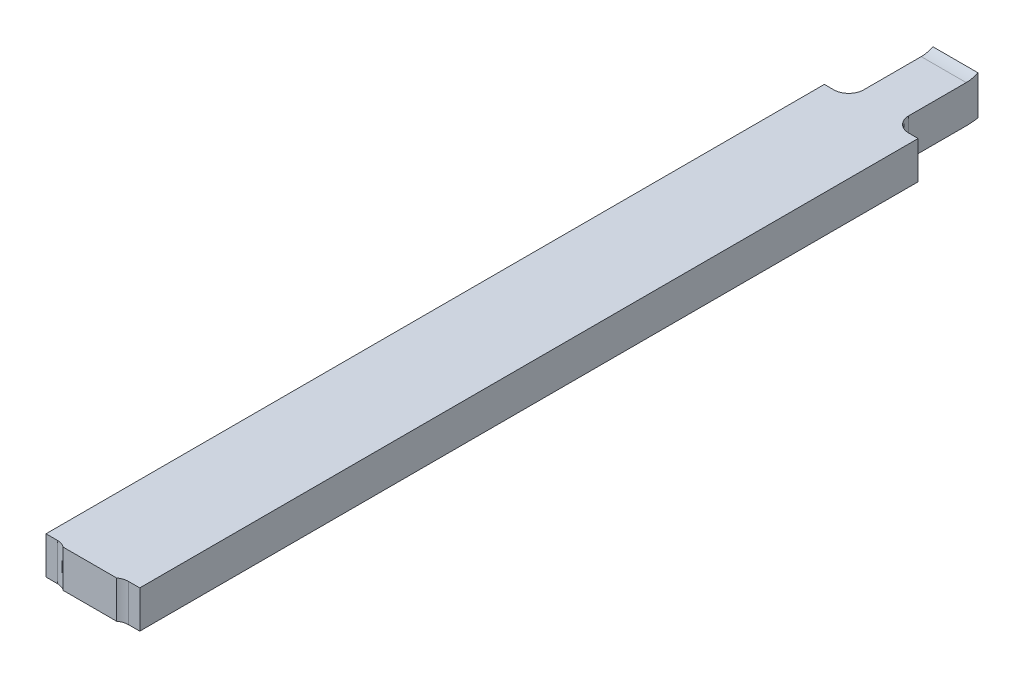
ISO-10303-21;
HEADER;
FILE_DESCRIPTION(('STEP AP214'),'2;1');
FILE_NAME('part.step','',(''),(''),'','','');
FILE_SCHEMA(('AUTOMOTIVE_DESIGN { 1 0 10303 214 1 1 1 1 }'));
ENDSEC;
DATA;
#1=APPLICATION_CONTEXT('core data for automotive mechanical design processes');
#2=APPLICATION_PROTOCOL_DEFINITION('international standard','automotive_design',2000,#1);
#3=PRODUCT_CONTEXT('',#1,'mechanical');
#4=PRODUCT('Part','Part','',(#3));
#5=PRODUCT_RELATED_PRODUCT_CATEGORY('part','',(#4));
#6=PRODUCT_DEFINITION_FORMATION('','',#4);
#7=PRODUCT_DEFINITION_CONTEXT('part definition',#1,'design');
#8=PRODUCT_DEFINITION('design','',#6,#7);
#9=PRODUCT_DEFINITION_SHAPE('','',#8);
#10=(LENGTH_UNIT() NAMED_UNIT(*) SI_UNIT(.MILLI.,.METRE.));
#11=(NAMED_UNIT(*) PLANE_ANGLE_UNIT() SI_UNIT($,.RADIAN.));
#12=(NAMED_UNIT(*) SI_UNIT($,.STERADIAN.) SOLID_ANGLE_UNIT());
#13=UNCERTAINTY_MEASURE_WITH_UNIT(LENGTH_MEASURE(1.E-05),#10,'distance_accuracy_value','');
#14=(GEOMETRIC_REPRESENTATION_CONTEXT(3) GLOBAL_UNCERTAINTY_ASSIGNED_CONTEXT((#13)) GLOBAL_UNIT_ASSIGNED_CONTEXT((#10,
#11,#12)) REPRESENTATION_CONTEXT('',''));
#15=CARTESIAN_POINT('',(0.,0.,0.));
#16=DIRECTION('',(0.,0.,1.));
#17=DIRECTION('',(1.,0.,0.));
#18=AXIS2_PLACEMENT_3D('',#15,#16,#17);
#19=CARTESIAN_POINT('',(-3.,-0.3652289464185,-7.500488855463));
#20=DIRECTION('',(0.,0.,1.));
#21=DIRECTION('',(1.,0.,0.));
#22=AXIS2_PLACEMENT_3D('',#19,#20,#21);
#23=PLANE('',#22);
#24=DIRECTION('',(0.,1.,0.));
#25=VECTOR('',#24,1.);
#26=CARTESIAN_POINT('',(-2.88,-0.3694122088881,-7.500488855463));
#27=LINE('',#26,#25);
#28=CARTESIAN_POINT('',(-2.88,-0.469296338681694,-7.50048885546298));
#29=VERTEX_POINT('',#28);
#30=CARTESIAN_POINT('',(-2.88,-0.261161554155171,-7.50048885546301));
#31=VERTEX_POINT('',#30);
#32=EDGE_CURVE('E150',#29,#31,#27,.T.);
#33=ORIENTED_EDGE('',*,*,#32,.F.);
#34=DIRECTION('',(-1.,0.,0.));
#35=VECTOR('',#34,1.);
#36=CARTESIAN_POINT('',(-2.874272716281,-0.469296338681697,-7.50048885546296));
#37=LINE('',#36,#35);
#38=CARTESIAN_POINT('',(-3.12,-0.469296338681694,-7.50048885546298));
#39=VERTEX_POINT('',#38);
#40=EDGE_CURVE('E139',#39,#29,#37,.F.);
#41=ORIENTED_EDGE('',*,*,#40,.F.);
#42=DIRECTION('',(0.,1.,0.));
#43=VECTOR('',#42,1.);
#44=CARTESIAN_POINT('',(-3.12,-0.3694122088881,-7.500488855463));
#45=LINE('',#44,#43);
#46=CARTESIAN_POINT('',(-3.12,-0.261161554155171,-7.50048885546301));
#47=VERTEX_POINT('',#46);
#48=EDGE_CURVE('E535',#39,#47,#45,.T.);
#49=ORIENTED_EDGE('',*,*,#48,.T.);
#50=DIRECTION('',(1.,0.,0.));
#51=VECTOR('',#50,1.);
#52=CARTESIAN_POINT('',(-3.125727283719,-0.261161554155164,-7.50048885546303));
#53=LINE('',#52,#51);
#54=EDGE_CURVE('E147',#47,#31,#53,.T.);
#55=ORIENTED_EDGE('',*,*,#54,.T.);
#56=EDGE_LOOP('',(#33,#41,#49,#55));
#57=FACE_BOUND('',#56,.T.);
#58=ADVANCED_FACE('F17',(#57),#23,.F.);
#59=CARTESIAN_POINT('',(-2.874272716281,-0.125,-7.43756007691));
#60=DIRECTION('',(-1.,0.,0.));
#61=DIRECTION('',(0.,0.,1.));
#62=AXIS2_PLACEMENT_3D('',#59,#60,#61);
#63=CYLINDRICAL_SURFACE('',#62,0.3499999999997);
#64=CARTESIAN_POINT('',(-3.12,-0.125,-7.43756007691));
#65=DIRECTION('',(-1.,0.,0.));
#66=DIRECTION('',(0.,0.,1.));
#67=AXIS2_PLACEMENT_3D('',#64,#65,#66);
#68=CIRCLE('',#67,0.3499999999997);
#69=CARTESIAN_POINT('',(-3.12,-0.475,-7.43756007691));
#70=VERTEX_POINT('',#69);
#71=EDGE_CURVE('E250',#70,#39,#68,.F.);
#72=ORIENTED_EDGE('',*,*,#71,.T.);
#73=ORIENTED_EDGE('',*,*,#40,.T.);
#74=CARTESIAN_POINT('',(-2.88,-0.125,-7.43756007691));
#75=DIRECTION('',(-1.,0.,0.));
#76=DIRECTION('',(0.,0.,1.));
#77=AXIS2_PLACEMENT_3D('',#74,#75,#76);
#78=CIRCLE('',#77,0.3499999999997);
#79=CARTESIAN_POINT('',(-2.88,-0.475,-7.43756007691));
#80=VERTEX_POINT('',#79);
#81=EDGE_CURVE('E274',#80,#29,#78,.F.);
#82=ORIENTED_EDGE('',*,*,#81,.F.);
#83=DIRECTION('',(1.,0.,0.));
#84=VECTOR('',#83,1.);
#85=CARTESIAN_POINT('',(-3.,-0.475,-7.43756007691));
#86=LINE('',#85,#84);
#87=EDGE_CURVE('E138',#80,#70,#86,.F.);
#88=ORIENTED_EDGE('',*,*,#87,.T.);
#89=EDGE_LOOP('',(#72,#73,#82,#88));
#90=FACE_BOUND('',#89,.T.);
#91=ADVANCED_FACE('F255',(#90),#63,.T.);
#92=CARTESIAN_POINT('',(-3.,-0.475,-5.160844573418));
#93=DIRECTION('',(0.,1.,0.));
#94=DIRECTION('',(0.,0.,1.));
#95=AXIS2_PLACEMENT_3D('',#92,#93,#94);
#96=PLANE('',#95);
#97=DIRECTION('',(1.,0.,0.));
#98=VECTOR('',#97,1.);
#99=CARTESIAN_POINT('',(-3.,-0.475,-2.9));
#100=LINE('',#99,#98);
#101=CARTESIAN_POINT('',(-3.25,-0.475,-2.9));
#102=VERTEX_POINT('',#101);
#103=CARTESIAN_POINT('',(-3.19,-0.475,-2.89999999999976));
#104=VERTEX_POINT('',#103);
#105=EDGE_CURVE('E118',#102,#104,#100,.T.);
#106=ORIENTED_EDGE('',*,*,#105,.F.);
#107=DIRECTION('',(0.,0.,-1.));
#108=VECTOR('',#107,1.);
#109=CARTESIAN_POINT('',(-3.25,-0.475,-4.975579331992));
#110=LINE('',#109,#108);
#111=CARTESIAN_POINT('',(-3.25,-0.475,-7.051158663985));
#112=VERTEX_POINT('',#111);
#113=EDGE_CURVE('E213',#102,#112,#110,.T.);
#114=ORIENTED_EDGE('',*,*,#113,.T.);
#115=DIRECTION('',(1.,0.,0.));
#116=VECTOR('',#115,1.);
#117=CARTESIAN_POINT('',(-3.225,-0.475,-7.051158663985));
#118=LINE('',#117,#116);
#119=CARTESIAN_POINT('',(-3.2,-0.475,-7.05115866398505));
#120=VERTEX_POINT('',#119);
#121=EDGE_CURVE('E218',#112,#120,#118,.T.);
#122=ORIENTED_EDGE('',*,*,#121,.T.);
#123=CARTESIAN_POINT('',(-3.11999999999968,-0.475,-7.131158663985));
#124=CARTESIAN_POINT('',(-3.12000887559487,-0.475,-7.12663228539965));
#125=CARTESIAN_POINT('',(-3.12039503047314,-0.475,-7.12211245444065));
#126=CARTESIAN_POINT('',(-3.12191562674134,-0.475,-7.11320506981296));
#127=CARTESIAN_POINT('',(-3.12304939310094,-0.475,-7.10881740054698));
#128=CARTESIAN_POINT('',(-3.127556185534,-0.475,-7.09604021502535));
#129=CARTESIAN_POINT('',(-3.13203481865039,-0.475,-7.08801257629079));
#130=CARTESIAN_POINT('',(-3.14334118864264,-0.475,-7.07397145931294));
#131=CARTESIAN_POINT('',(-3.15014907486861,-0.475,-7.06794178198468));
#132=CARTESIAN_POINT('',(-3.16542981568032,-0.475,-7.05845747919416));
#133=CARTESIAN_POINT('',(-3.17391091624519,-0.475,-7.05501603051908));
#134=CARTESIAN_POINT('',(-3.18838450867067,-0.475,-7.05178938735803));
#135=CARTESIAN_POINT('',(-3.19419660039155,-0.475,-7.05114165155808));
#136=CARTESIAN_POINT('',(-3.2,-0.475,-7.05115866398511));
#137=B_SPLINE_CURVE_WITH_KNOTS('',3,(#123,#124,#125,#126,#127,#128,#129,#130,#131,#132,#133,
#134,#135,#136),.UNSPECIFIED.,.F.,.F.,(4,2,2,2,2,2,4),(0.,0.0135512792184551,0.0270903394941943,
0.0541002294468548,0.0808854407468838,0.107806110463943,0.125207976056707),.UNSPECIFIED.);
#138=CARTESIAN_POINT('',(-3.11999999999984,-0.475,-7.131158663985));
#139=VERTEX_POINT('',#138);
#140=EDGE_CURVE('E239',#139,#120,#137,.T.);
#141=ORIENTED_EDGE('',*,*,#140,.F.);
#142=DIRECTION('',(0.,0.,-1.));
#143=VECTOR('',#142,1.);
#144=CARTESIAN_POINT('',(-3.12,-0.475,-7.317732357319));
#145=LINE('',#144,#143);
#146=EDGE_CURVE('E537',#139,#70,#145,.T.);
#147=ORIENTED_EDGE('',*,*,#146,.T.);
#148=ORIENTED_EDGE('',*,*,#87,.F.);
#149=DIRECTION('',(0.,0.,-1.));
#150=VECTOR('',#149,1.);
#151=CARTESIAN_POINT('',(-2.88,-0.475,-7.317732357319));
#152=LINE('',#151,#150);
#153=CARTESIAN_POINT('',(-2.87999999999995,-0.475,-7.131158663985));
#154=VERTEX_POINT('',#153);
#155=EDGE_CURVE('E533',#154,#80,#152,.T.);
#156=ORIENTED_EDGE('',*,*,#155,.F.);
#157=CARTESIAN_POINT('',(-2.8,-0.475,-7.05115866398468));
#158=CARTESIAN_POINT('',(-2.80452637858535,-0.475,-7.05116753957987));
#159=CARTESIAN_POINT('',(-2.80904620954434,-0.475,-7.05155369445814));
#160=CARTESIAN_POINT('',(-2.81795359417201,-0.475,-7.05307429072634));
#161=CARTESIAN_POINT('',(-2.82234126343798,-0.475,-7.05420805708593));
#162=CARTESIAN_POINT('',(-2.8351184489596,-0.475,-7.05871484951897));
#163=CARTESIAN_POINT('',(-2.84314608769414,-0.475,-7.06319348263535));
#164=CARTESIAN_POINT('',(-2.85718720467199,-0.475,-7.07449985262756));
#165=CARTESIAN_POINT('',(-2.86321688200025,-0.475,-7.08130773885352));
#166=CARTESIAN_POINT('',(-2.87270118479079,-0.475,-7.09658847966521));
#167=CARTESIAN_POINT('',(-2.87614263346588,-0.475,-7.10506958023008));
#168=CARTESIAN_POINT('',(-2.87936927662697,-0.475,-7.1195431726556));
#169=CARTESIAN_POINT('',(-2.88001701242693,-0.475,-7.12535526437652));
#170=CARTESIAN_POINT('',(-2.8799999999999,-0.475,-7.131158663985));
#171=B_SPLINE_CURVE_WITH_KNOTS('',3,(#157,#158,#159,#160,#161,#162,#163,#164,#165,#166,#167,
#168,#169,#170),.UNSPECIFIED.,.F.,.F.,(4,2,2,2,2,2,4),(0.,0.0135512792184316,0.0270903394941471,
0.054100229446755,0.0808854407467618,0.107806110463832,0.125207976056706),.UNSPECIFIED.);
#172=CARTESIAN_POINT('',(-2.8,-0.475,-7.05115866398484));
#173=VERTEX_POINT('',#172);
#174=EDGE_CURVE('E266',#173,#154,#171,.T.);
#175=ORIENTED_EDGE('',*,*,#174,.F.);
#176=DIRECTION('',(1.,0.,0.));
#177=VECTOR('',#176,1.);
#178=CARTESIAN_POINT('',(-2.775,-0.475,-7.051158663985));
#179=LINE('',#178,#177);
#180=CARTESIAN_POINT('',(-2.75,-0.475,-7.051158663985));
#181=VERTEX_POINT('',#180);
#182=EDGE_CURVE('E151',#173,#181,#179,.T.);
#183=ORIENTED_EDGE('',*,*,#182,.T.);
#184=DIRECTION('',(0.,0.,-1.));
#185=VECTOR('',#184,1.);
#186=CARTESIAN_POINT('',(-2.75,-0.475,-4.975579331992));
#187=LINE('',#186,#185);
#188=CARTESIAN_POINT('',(-2.75,-0.475,-2.9));
#189=VERTEX_POINT('',#188);
#190=EDGE_CURVE('E155',#189,#181,#187,.T.);
#191=ORIENTED_EDGE('',*,*,#190,.F.);
#192=DIRECTION('',(1.,0.,0.));
#193=VECTOR('',#192,1.);
#194=CARTESIAN_POINT('',(-2.78,-0.475,-2.9));
#195=LINE('',#194,#193);
#196=CARTESIAN_POINT('',(-2.81,-0.475,-2.89999999999989));
#197=VERTEX_POINT('',#196);
#198=EDGE_CURVE('E163',#197,#189,#195,.T.);
#199=ORIENTED_EDGE('',*,*,#198,.F.);
#200=CARTESIAN_POINT('',(-2.85782455242115,-0.475,-2.8841290699251));
#201=CARTESIAN_POINT('',(-2.85377977929529,-0.475,-2.88715347788678));
#202=CARTESIAN_POINT('',(-2.8494455741793,-0.475,-2.88978498732686));
#203=CARTESIAN_POINT('',(-2.84086630502368,-0.475,-2.8939430866676));
#204=CARTESIAN_POINT('',(-2.83666481589101,-0.475,-2.89555994023161));
#205=CARTESIAN_POINT('',(-2.82805119057801,-0.475,-2.89806057790455));
#206=CARTESIAN_POINT('',(-2.82363918895056,-0.475,-2.89894482380699));
#207=CARTESIAN_POINT('',(-2.81613636516881,-0.475,-2.89981357444961));
#208=CARTESIAN_POINT('',(-2.81306715843202,-0.475,-2.89999375978714));
#209=CARTESIAN_POINT('',(-2.81,-0.475,-2.89999999999978));
#210=B_SPLINE_CURVE_WITH_KNOTS('',3,(#200,#201,#202,#203,#204,#205,#206,#207,#208,#209),
.UNSPECIFIED.,.F.,.F.,(4,2,2,2,4),(0.,0.0151223248428412,0.0285648972663099,0.0419989898086804,
0.051201287101397),.UNSPECIFIED.);
#211=CARTESIAN_POINT('',(-2.85782455242108,-0.475,-2.88412906992505));
#212=VERTEX_POINT('',#211);
#213=EDGE_CURVE('E125',#212,#197,#210,.T.);
#214=ORIENTED_EDGE('',*,*,#213,.F.);
#215=DIRECTION('',(1.,0.,0.));
#216=VECTOR('',#215,1.);
#217=CARTESIAN_POINT('',(-3.,-0.475,-2.884129069925));
#218=LINE('',#217,#216);
#219=CARTESIAN_POINT('',(-3.14217543362795,-0.475,-2.88412906992502));
#220=VERTEX_POINT('',#219);
#221=EDGE_CURVE('E129',#220,#212,#218,.T.);
#222=ORIENTED_EDGE('',*,*,#221,.F.);
#223=CARTESIAN_POINT('',(-3.19,-0.475,-2.89999999999952));
#224=CARTESIAN_POINT('',(-3.18496730361836,-0.475,-2.90001482409384));
#225=CARTESIAN_POINT('',(-3.17991815783308,-0.475,-2.89952557596737));
#226=CARTESIAN_POINT('',(-3.16614771604894,-0.475,-2.89686256447201));
#227=CARTESIAN_POINT('',(-3.15760052391877,-0.475,-2.89367998586962));
#228=CARTESIAN_POINT('',(-3.14719213429874,-0.475,-2.88765952253235));
#229=CARTESIAN_POINT('',(-3.14462559871613,-0.475,-2.88596721904186));
#230=CARTESIAN_POINT('',(-3.1421754336279,-0.475,-2.88412906992503));
#231=B_SPLINE_CURVE_WITH_KNOTS('',3,(#223,#224,#225,#226,#227,#228,#229,#230),.UNSPECIFIED.,.F.,
.F.,(4,2,2,4),(0.,0.0151178951010511,0.0419060489799015,0.0511063402020694),.UNSPECIFIED.);
#232=EDGE_CURVE('E20',#104,#220,#231,.T.);
#233=ORIENTED_EDGE('',*,*,#232,.F.);
#234=EDGE_LOOP('',(#106,#114,#122,#141,#147,#148,#156,#175,#183,#191,#199,#214,#222,#233));
#235=FACE_BOUND('',#234,.T.);
#236=ADVANCED_FACE('F135',(#235),#96,.F.);
#237=CARTESIAN_POINT('',(-2.807132391521,-0.269272716281,-2.899957930186));
#238=CARTESIAN_POINT('',(-2.808087324483,-0.269272716281,-2.899988554812));
#239=CARTESIAN_POINT('',(-2.814268512342,-0.269272716281,-2.900079343105));
#240=CARTESIAN_POINT('',(-2.825708586311,-0.269272716281,-2.898963559635));
#241=CARTESIAN_POINT('',(-2.840809082916,-0.269272716281,-2.894390814224));
#242=CARTESIAN_POINT('',(-2.8513126737,-0.269272716281,-2.888776760997));
#243=CARTESIAN_POINT('',(-2.858278976833,-0.269272716281,-2.883851645707));
#244=CARTESIAN_POINT('',(-2.860847948139,-0.269272716281,-2.881786274905));
#245=CARTESIAN_POINT('',(-2.862294521887,-0.269272716281,-2.880535760884));
#246=(BOUNDED_CURVE() B_SPLINE_CURVE(3,(#237,#238,#239,#240,#241,#242,#243,#244,#245),
.UNSPECIFIED.,.F.,.F.) B_SPLINE_CURVE_WITH_KNOTS((4,1,1,1,1,1,4),(0.,0.0480076126077,
0.3103664664067,0.5726487803877,0.8349383013298,0.9041878403074,1.),
.UNSPECIFIED.) CURVE() GEOMETRIC_REPRESENTATION_ITEM() RATIONAL_B_SPLINE_CURVE((1.,1.,1.,1.,1.,
1.,1.,1.,1.)) REPRESENTATION_ITEM(''));
#247=DIRECTION('',(0.,-1.,0.));
#248=VECTOR('',#247,1.);
#249=SURFACE_OF_LINEAR_EXTRUSION('',#246,#248);
#250=CARTESIAN_POINT('',(-2.85782455535254,-0.275,-2.88412906773656));
#251=CARTESIAN_POINT('',(-2.85377978236567,-0.275,-2.88715347588347));
#252=CARTESIAN_POINT('',(-2.84944557737024,-0.275,-2.88978498552233));
#253=CARTESIAN_POINT('',(-2.84086630840598,-0.275,-2.89394308525624));
#254=CARTESIAN_POINT('',(-2.83666481934832,-0.275,-2.89555993901277));
#255=CARTESIAN_POINT('',(-2.82805119415026,-0.275,-2.89806057708112));
#256=CARTESIAN_POINT('',(-2.82363919256266,-0.275,-2.89894482318607));
#257=CARTESIAN_POINT('',(-2.81613636760673,-0.275,-2.89981357430863));
#258=CARTESIAN_POINT('',(-2.81306715965084,-0.275,-2.89999375978684));
#259=CARTESIAN_POINT('',(-2.81,-0.275,-2.89999999999978));
#260=B_SPLINE_CURVE_WITH_KNOTS('',3,(#250,#251,#252,#253,#254,#255,#256,#257,#258,#259),
.UNSPECIFIED.,.F.,.F.,(4,2,2,2,4),(0.,0.0151223248426713,0.0285648972632506,0.041998989809675,
0.0512012907536544),.UNSPECIFIED.);
#261=CARTESIAN_POINT('',(-2.85782455388677,-0.275,-2.88412906883078));
#262=VERTEX_POINT('',#261);
#263=CARTESIAN_POINT('',(-2.81,-0.275,-2.9));
#264=VERTEX_POINT('',#263);
#265=EDGE_CURVE('E132',#262,#264,#260,.T.);
#266=ORIENTED_EDGE('',*,*,#265,.F.);
#267=DIRECTION('',(0.,1.,0.));
#268=VECTOR('',#267,1.);
#269=CARTESIAN_POINT('',(-2.857824552421,-0.375,-2.884129069925));
#270=LINE('',#269,#268);
#271=EDGE_CURVE('E133',#212,#262,#270,.T.);
#272=ORIENTED_EDGE('',*,*,#271,.F.);
#273=ORIENTED_EDGE('',*,*,#213,.T.);
#274=DIRECTION('',(0.,1.,0.));
#275=VECTOR('',#274,1.);
#276=CARTESIAN_POINT('',(-2.81,-0.375,-2.9));
#277=LINE('',#276,#275);
#278=EDGE_CURVE('E166',#264,#197,#277,.F.);
#279=ORIENTED_EDGE('',*,*,#278,.F.);
#280=EDGE_LOOP('',(#266,#272,#273,#279));
#281=FACE_BOUND('',#280,.T.);
#282=ADVANCED_FACE('F254',(#281),#249,.T.);
#283=CARTESIAN_POINT('',(-2.78,-0.375,-2.9));
#284=DIRECTION('',(0.,0.,1.));
#285=DIRECTION('',(1.,0.,0.));
#286=AXIS2_PLACEMENT_3D('',#283,#284,#285);
#287=PLANE('',#286);
#288=DIRECTION('',(0.,1.,0.));
#289=VECTOR('',#288,1.);
#290=CARTESIAN_POINT('',(-2.75,-0.375,-2.9));
#291=LINE('',#290,#289);
#292=CARTESIAN_POINT('',(-2.75,-0.275,-2.9));
#293=VERTEX_POINT('',#292);
#294=EDGE_CURVE('E160',#293,#189,#291,.F.);
#295=ORIENTED_EDGE('',*,*,#294,.F.);
#296=DIRECTION('',(1.,0.,0.));
#297=VECTOR('',#296,1.);
#298=CARTESIAN_POINT('',(-3.,-0.275,-2.9));
#299=LINE('',#298,#297);
#300=EDGE_CURVE('E306',#264,#293,#299,.T.);
#301=ORIENTED_EDGE('',*,*,#300,.F.);
#302=ORIENTED_EDGE('',*,*,#278,.T.);
#303=ORIENTED_EDGE('',*,*,#198,.T.);
#304=EDGE_LOOP('',(#295,#301,#302,#303));
#305=FACE_BOUND('',#304,.T.);
#306=ADVANCED_FACE('F368',(#305),#287,.T.);
#307=CARTESIAN_POINT('',(-2.75,-0.375,-4.975579331992));
#308=DIRECTION('',(1.,0.,0.));
#309=DIRECTION('',(0.,0.,-1.));
#310=AXIS2_PLACEMENT_3D('',#307,#308,#309);
#311=PLANE('',#310);
#312=DIRECTION('',(0.,1.,0.));
#313=VECTOR('',#312,1.);
#314=CARTESIAN_POINT('',(-2.75,-0.375,-7.051158663985));
#315=LINE('',#314,#313);
#316=CARTESIAN_POINT('',(-2.75,-0.275,-7.051158663985));
#317=VERTEX_POINT('',#316);
#318=EDGE_CURVE('E154',#181,#317,#315,.T.);
#319=ORIENTED_EDGE('',*,*,#318,.T.);
#320=DIRECTION('',(0.,0.,1.));
#321=VECTOR('',#320,1.);
#322=CARTESIAN_POINT('',(-2.75,-0.275,-5.160844573418));
#323=LINE('',#322,#321);
#324=EDGE_CURVE('E302',#293,#317,#323,.F.);
#325=ORIENTED_EDGE('',*,*,#324,.F.);
#326=ORIENTED_EDGE('',*,*,#294,.T.);
#327=ORIENTED_EDGE('',*,*,#190,.T.);
#328=EDGE_LOOP('',(#319,#325,#326,#327));
#329=FACE_BOUND('',#328,.T.);
#330=ADVANCED_FACE('F373',(#329),#311,.T.);
#331=CARTESIAN_POINT('',(-2.775,-0.375,-7.051158663985));
#332=DIRECTION('',(0.,0.,1.));
#333=DIRECTION('',(1.,0.,0.));
#334=AXIS2_PLACEMENT_3D('',#331,#332,#333);
#335=PLANE('',#334);
#336=ORIENTED_EDGE('',*,*,#182,.F.);
#337=DIRECTION('',(0.,-1.,0.));
#338=VECTOR('',#337,1.);
#339=CARTESIAN_POINT('',(-2.8,-0.269272716281,-7.05115866398468));
#340=LINE('',#339,#338);
#341=CARTESIAN_POINT('',(-2.8,-0.275,-7.05115866398476));
#342=VERTEX_POINT('',#341);
#343=EDGE_CURVE('E273',#342,#173,#340,.T.);
#344=ORIENTED_EDGE('',*,*,#343,.F.);
#345=DIRECTION('',(1.,0.,0.));
#346=VECTOR('',#345,1.);
#347=CARTESIAN_POINT('',(-3.,-0.275,-7.051158663985));
#348=LINE('',#347,#346);
#349=EDGE_CURVE('E305',#317,#342,#348,.F.);
#350=ORIENTED_EDGE('',*,*,#349,.F.);
#351=ORIENTED_EDGE('',*,*,#318,.F.);
#352=EDGE_LOOP('',(#336,#344,#350,#351));
#353=FACE_BOUND('',#352,.T.);
#354=ADVANCED_FACE('F283',(#353),#335,.F.);
#355=CARTESIAN_POINT('',(-2.879957929587,-0.269272716281,-7.134026291144));
#356=CARTESIAN_POINT('',(-2.879988554629,-0.269272716281,-7.133071351971));
#357=CARTESIAN_POINT('',(-2.880079343715,-0.269272716281,-7.126890157897));
#358=CARTESIAN_POINT('',(-2.878963559635,-0.269272716281,-7.115450077674));
#359=CARTESIAN_POINT('',(-2.874390814224,-0.269272716281,-7.100349581069));
#360=CARTESIAN_POINT('',(-2.866951052025,-0.269272716281,-7.086430187272));
#361=CARTESIAN_POINT('',(-2.856931304376,-0.269272716281,-7.074236320435));
#362=CARTESIAN_POINT('',(-2.844737903504,-0.269272716281,-7.064213675467));
#363=CARTESIAN_POINT('',(-2.830816201624,-0.269272716281,-7.056770327068));
#364=CARTESIAN_POINT('',(-2.815712040492,-0.269272716281,-7.05219575577));
#365=CARTESIAN_POINT('',(-2.804270485404,-0.269272716281,-7.051079350384));
#366=CARTESIAN_POINT('',(-2.798089320739,-0.269272716281,-7.051170096432));
#367=CARTESIAN_POINT('',(-2.797135381259,-0.269272716281,-7.0512006723));
#368=(BOUNDED_CURVE() B_SPLINE_CURVE(3,(#355,#356,#357,#358,#359,#360,#361,#362,#363,#364,#365,
#366,#367),.UNSPECIFIED.,.F.,.F.) B_SPLINE_CURVE_WITH_KNOTS((4,1,1,1,1,1,1,1,1,1,4),(0.,
0.02187366901522,0.1414112381412,0.260913933719,0.380419912977,0.4999590271853,0.6195124003892,
0.7390518477007,0.8585895788734,0.9781493142558,1.),
.UNSPECIFIED.) CURVE() GEOMETRIC_REPRESENTATION_ITEM() RATIONAL_B_SPLINE_CURVE((1.,1.,1.,1.,1.,
1.,1.,1.,1.,1.,1.,1.,1.)) REPRESENTATION_ITEM(''));
#369=DIRECTION('',(0.,-1.,0.));
#370=VECTOR('',#369,1.);
#371=SURFACE_OF_LINEAR_EXTRUSION('',#368,#370);
#372=DIRECTION('',(0.,1.,0.));
#373=VECTOR('',#372,1.);
#374=CARTESIAN_POINT('',(-2.88,-0.3694122088881,-7.131158663985));
#375=LINE('',#374,#373);
#376=CARTESIAN_POINT('',(-2.88,-0.275,-7.131158663985));
#377=VERTEX_POINT('',#376);
#378=EDGE_CURVE('E272',#377,#154,#375,.F.);
#379=ORIENTED_EDGE('',*,*,#378,.F.);
#380=CARTESIAN_POINT('',(-2.8,-0.275,-7.05115866398468));
#381=CARTESIAN_POINT('',(-2.80452637858535,-0.275,-7.05116753957987));
#382=CARTESIAN_POINT('',(-2.80904620954434,-0.275,-7.05155369445814));
#383=CARTESIAN_POINT('',(-2.81795359417201,-0.275,-7.05307429072634));
#384=CARTESIAN_POINT('',(-2.82234126343798,-0.275,-7.05420805708593));
#385=CARTESIAN_POINT('',(-2.8351184489596,-0.275,-7.05871484951897));
#386=CARTESIAN_POINT('',(-2.84314608769414,-0.275,-7.06319348263535));
#387=CARTESIAN_POINT('',(-2.85718720467199,-0.275,-7.07449985262756));
#388=CARTESIAN_POINT('',(-2.86321688200025,-0.275,-7.08130773885352));
#389=CARTESIAN_POINT('',(-2.87270118479079,-0.275,-7.09658847966521));
#390=CARTESIAN_POINT('',(-2.87614263346588,-0.275,-7.10506958023008));
#391=CARTESIAN_POINT('',(-2.87936927662697,-0.275,-7.1195431726556));
#392=CARTESIAN_POINT('',(-2.88001701242693,-0.275,-7.12535526437652));
#393=CARTESIAN_POINT('',(-2.8799999999999,-0.275,-7.131158663985));
#394=B_SPLINE_CURVE_WITH_KNOTS('',3,(#380,#381,#382,#383,#384,#385,#386,#387,#388,#389,#390,
#391,#392,#393),.UNSPECIFIED.,.F.,.F.,(4,2,2,2,2,2,4),(0.,0.0135512792184316,0.0270903394941471,
0.054100229446755,0.0808854407467618,0.107806110463832,0.125207976056706),.UNSPECIFIED.);
#395=EDGE_CURVE('E355',#342,#377,#394,.T.);
#396=ORIENTED_EDGE('',*,*,#395,.F.);
#397=ORIENTED_EDGE('',*,*,#343,.T.);
#398=ORIENTED_EDGE('',*,*,#174,.T.);
#399=EDGE_LOOP('',(#379,#396,#397,#398));
#400=FACE_BOUND('',#399,.T.);
#401=ADVANCED_FACE('F276',(#400),#371,.T.);
#402=CARTESIAN_POINT('',(-2.88,-0.3694122088881,-7.317732357319));
#403=DIRECTION('',(1.,0.,0.));
#404=DIRECTION('',(0.,0.,-1.));
#405=AXIS2_PLACEMENT_3D('',#402,#403,#404);
#406=PLANE('',#405);
#407=ORIENTED_EDGE('',*,*,#81,.T.);
#408=ORIENTED_EDGE('',*,*,#32,.T.);
#409=CARTESIAN_POINT('',(-2.88,-0.125,-7.437560076911));
#410=DIRECTION('',(1.,0.,0.));
#411=DIRECTION('',(0.,0.,-1.));
#412=AXIS2_PLACEMENT_3D('',#409,#410,#411);
#413=CIRCLE('',#412,0.15);
#414=CARTESIAN_POINT('',(-2.88,-0.275,-7.437560076911));
#415=VERTEX_POINT('',#414);
#416=EDGE_CURVE('E149',#31,#415,#413,.F.);
#417=ORIENTED_EDGE('',*,*,#416,.T.);
#418=DIRECTION('',(0.,0.,1.));
#419=VECTOR('',#418,1.);
#420=CARTESIAN_POINT('',(-2.88,-0.275,-5.160844573418));
#421=LINE('',#420,#419);
#422=EDGE_CURVE('E348',#377,#415,#421,.F.);
#423=ORIENTED_EDGE('',*,*,#422,.F.);
#424=ORIENTED_EDGE('',*,*,#378,.T.);
#425=ORIENTED_EDGE('',*,*,#155,.T.);
#426=EDGE_LOOP('',(#407,#408,#417,#423,#424,#425));
#427=FACE_BOUND('',#426,.T.);
#428=ADVANCED_FACE('F282',(#427),#406,.T.);
#429=CARTESIAN_POINT('',(-3.125727283719,-0.125,-7.437560076911));
#430=DIRECTION('',(1.,0.,0.));
#431=DIRECTION('',(0.,0.,-1.));
#432=AXIS2_PLACEMENT_3D('',#429,#430,#431);
#433=CYLINDRICAL_SURFACE('',#432,0.15);
#434=DIRECTION('',(1.,0.,0.));
#435=VECTOR('',#434,1.);
#436=CARTESIAN_POINT('',(-3.,-0.275,-7.437560076911));
#437=LINE('',#436,#435);
#438=CARTESIAN_POINT('',(-3.12,-0.275,-7.437560076911));
#439=VERTEX_POINT('',#438);
#440=EDGE_CURVE('E346',#415,#439,#437,.F.);
#441=ORIENTED_EDGE('',*,*,#440,.F.);
#442=ORIENTED_EDGE('',*,*,#416,.F.);
#443=ORIENTED_EDGE('',*,*,#54,.F.);
#444=CARTESIAN_POINT('',(-3.12,-0.125,-7.437560076911));
#445=DIRECTION('',(1.,0.,0.));
#446=DIRECTION('',(0.,0.,-1.));
#447=AXIS2_PLACEMENT_3D('',#444,#445,#446);
#448=CIRCLE('',#447,0.15);
#449=EDGE_CURVE('E536',#47,#439,#448,.F.);
#450=ORIENTED_EDGE('',*,*,#449,.T.);
#451=EDGE_LOOP('',(#441,#442,#443,#450));
#452=FACE_BOUND('',#451,.T.);
#453=ADVANCED_FACE('F443',(#452),#433,.F.);
#454=CARTESIAN_POINT('',(-3.12,-0.3694122088881,-7.317732357319));
#455=DIRECTION('',(1.,0.,0.));
#456=DIRECTION('',(0.,0.,-1.));
#457=AXIS2_PLACEMENT_3D('',#454,#455,#456);
#458=PLANE('',#457);
#459=ORIENTED_EDGE('',*,*,#146,.F.);
#460=DIRECTION('',(0.,-1.,0.));
#461=VECTOR('',#460,1.);
#462=CARTESIAN_POINT('',(-3.11999999999968,-0.269272716281,-7.131158663985));
#463=LINE('',#462,#461);
#464=CARTESIAN_POINT('',(-3.11999999999976,-0.275,-7.131158663985));
#465=VERTEX_POINT('',#464);
#466=EDGE_CURVE('E223',#465,#139,#463,.T.);
#467=ORIENTED_EDGE('',*,*,#466,.F.);
#468=DIRECTION('',(0.,0.,1.));
#469=VECTOR('',#468,1.);
#470=CARTESIAN_POINT('',(-3.12,-0.275,-5.160844573418));
#471=LINE('',#470,#469);
#472=EDGE_CURVE('E345',#439,#465,#471,.T.);
#473=ORIENTED_EDGE('',*,*,#472,.F.);
#474=ORIENTED_EDGE('',*,*,#449,.F.);
#475=ORIENTED_EDGE('',*,*,#48,.F.);
#476=ORIENTED_EDGE('',*,*,#71,.F.);
#477=EDGE_LOOP('',(#459,#467,#473,#474,#475,#476));
#478=FACE_BOUND('',#477,.T.);
#479=ADVANCED_FACE('F234',(#478),#458,.F.);
#480=CARTESIAN_POINT('',(-3.202867627159,-0.269272716281,-7.051200734398));
#481=CARTESIAN_POINT('',(-3.201912687986,-0.269272716281,-7.051170109356));
#482=CARTESIAN_POINT('',(-3.195731493912,-0.269272716281,-7.05107932027));
#483=CARTESIAN_POINT('',(-3.184291413689,-0.269272716281,-7.05219510435));
#484=CARTESIAN_POINT('',(-3.169190917084,-0.269272716281,-7.056767849761));
#485=CARTESIAN_POINT('',(-3.155271523287,-0.269272716281,-7.06420761196));
#486=CARTESIAN_POINT('',(-3.14307765645,-0.269272716281,-7.074227359609));
#487=CARTESIAN_POINT('',(-3.133055011482,-0.269272716281,-7.086420760481));
#488=CARTESIAN_POINT('',(-3.125611663083,-0.269272716281,-7.100342462361));
#489=CARTESIAN_POINT('',(-3.121037091785,-0.269272716281,-7.115446623493));
#490=CARTESIAN_POINT('',(-3.119920686399,-0.269272716281,-7.126888178581));
#491=CARTESIAN_POINT('',(-3.120011432447,-0.269272716281,-7.133069343246));
#492=CARTESIAN_POINT('',(-3.120042008315,-0.269272716281,-7.134023282726));
#493=(BOUNDED_CURVE() B_SPLINE_CURVE(3,(#480,#481,#482,#483,#484,#485,#486,#487,#488,#489,#490,
#491,#492),.UNSPECIFIED.,.F.,.F.) B_SPLINE_CURVE_WITH_KNOTS((4,1,1,1,1,1,1,1,1,1,4),(0.,
0.02187366901522,0.1414112381413,0.260913933719,0.380419912977,0.4999590271853,0.6195124003892,
0.7390518477007,0.8585895788734,0.9781493142558,1.),
.UNSPECIFIED.) CURVE() GEOMETRIC_REPRESENTATION_ITEM() RATIONAL_B_SPLINE_CURVE((1.,1.,1.,1.,1.,
1.,1.,1.,1.,1.,1.,1.,1.)) REPRESENTATION_ITEM(''));
#494=DIRECTION('',(0.,-1.,0.));
#495=VECTOR('',#494,1.);
#496=SURFACE_OF_LINEAR_EXTRUSION('',#493,#495);
#497=DIRECTION('',(0.,1.,0.));
#498=VECTOR('',#497,1.);
#499=CARTESIAN_POINT('',(-3.2,-0.375,-7.051158663985));
#500=LINE('',#499,#498);
#501=CARTESIAN_POINT('',(-3.2,-0.275,-7.051158663985));
#502=VERTEX_POINT('',#501);
#503=EDGE_CURVE('E216',#120,#502,#500,.T.);
#504=ORIENTED_EDGE('',*,*,#503,.T.);
#505=CARTESIAN_POINT('',(-3.11999999999968,-0.275,-7.131158663985));
#506=CARTESIAN_POINT('',(-3.12000887559487,-0.275,-7.12663228539965));
#507=CARTESIAN_POINT('',(-3.12039503047314,-0.275,-7.12211245444065));
#508=CARTESIAN_POINT('',(-3.12191562674134,-0.275,-7.11320506981296));
#509=CARTESIAN_POINT('',(-3.12304939310094,-0.275,-7.10881740054698));
#510=CARTESIAN_POINT('',(-3.127556185534,-0.275,-7.09604021502535));
#511=CARTESIAN_POINT('',(-3.13203481865039,-0.275,-7.08801257629079));
#512=CARTESIAN_POINT('',(-3.14334118864264,-0.275,-7.07397145931294));
#513=CARTESIAN_POINT('',(-3.15014907486861,-0.275,-7.06794178198468));
#514=CARTESIAN_POINT('',(-3.16542981568032,-0.275,-7.05845747919416));
#515=CARTESIAN_POINT('',(-3.17391091624519,-0.275,-7.05501603051908));
#516=CARTESIAN_POINT('',(-3.18838450867067,-0.275,-7.05178938735803));
#517=CARTESIAN_POINT('',(-3.19419660039155,-0.275,-7.05114165155808));
#518=CARTESIAN_POINT('',(-3.2,-0.275,-7.05115866398511));
#519=B_SPLINE_CURVE_WITH_KNOTS('',3,(#505,#506,#507,#508,#509,#510,#511,#512,#513,#514,#515,
#516,#517,#518),.UNSPECIFIED.,.F.,.F.,(4,2,2,2,2,2,4),(0.,0.0135512792184551,0.0270903394941943,
0.0541002294468548,0.0808854407468838,0.107806110463943,0.125207976056707),.UNSPECIFIED.);
#520=EDGE_CURVE('E175',#465,#502,#519,.T.);
#521=ORIENTED_EDGE('',*,*,#520,.F.);
#522=ORIENTED_EDGE('',*,*,#466,.T.);
#523=ORIENTED_EDGE('',*,*,#140,.T.);
#524=EDGE_LOOP('',(#504,#521,#522,#523));
#525=FACE_BOUND('',#524,.T.);
#526=ADVANCED_FACE('F228',(#525),#496,.T.);
#527=CARTESIAN_POINT('',(-3.225,-0.375,-7.051158663985));
#528=DIRECTION('',(0.,0.,1.));
#529=DIRECTION('',(1.,0.,0.));
#530=AXIS2_PLACEMENT_3D('',#527,#528,#529);
#531=PLANE('',#530);
#532=ORIENTED_EDGE('',*,*,#121,.F.);
#533=DIRECTION('',(0.,1.,0.));
#534=VECTOR('',#533,1.);
#535=CARTESIAN_POINT('',(-3.25,-0.375,-7.051158663985));
#536=LINE('',#535,#534);
#537=CARTESIAN_POINT('',(-3.25,-0.275,-7.051158663985));
#538=VERTEX_POINT('',#537);
#539=EDGE_CURVE('E202',#112,#538,#536,.T.);
#540=ORIENTED_EDGE('',*,*,#539,.T.);
#541=DIRECTION('',(1.,0.,0.));
#542=VECTOR('',#541,1.);
#543=CARTESIAN_POINT('',(-3.,-0.275,-7.051158663985));
#544=LINE('',#543,#542);
#545=EDGE_CURVE('E208',#502,#538,#544,.F.);
#546=ORIENTED_EDGE('',*,*,#545,.F.);
#547=ORIENTED_EDGE('',*,*,#503,.F.);
#548=EDGE_LOOP('',(#532,#540,#546,#547));
#549=FACE_BOUND('',#548,.T.);
#550=ADVANCED_FACE('F233',(#549),#531,.F.);
#551=CARTESIAN_POINT('',(-3.25,-0.375,-4.975579331992));
#552=DIRECTION('',(1.,0.,0.));
#553=DIRECTION('',(0.,0.,-1.));
#554=AXIS2_PLACEMENT_3D('',#551,#552,#553);
#555=PLANE('',#554);
#556=ORIENTED_EDGE('',*,*,#113,.F.);
#557=DIRECTION('',(0.,1.,0.));
#558=VECTOR('',#557,1.);
#559=CARTESIAN_POINT('',(-3.25,-0.375,-2.9));
#560=LINE('',#559,#558);
#561=CARTESIAN_POINT('',(-3.25,-0.275,-2.9));
#562=VERTEX_POINT('',#561);
#563=EDGE_CURVE('E200',#562,#102,#560,.F.);
#564=ORIENTED_EDGE('',*,*,#563,.F.);
#565=DIRECTION('',(0.,0.,1.));
#566=VECTOR('',#565,1.);
#567=CARTESIAN_POINT('',(-3.25,-0.275,-5.160844573418));
#568=LINE('',#567,#566);
#569=EDGE_CURVE('E205',#538,#562,#568,.T.);
#570=ORIENTED_EDGE('',*,*,#569,.F.);
#571=ORIENTED_EDGE('',*,*,#539,.F.);
#572=EDGE_LOOP('',(#556,#564,#570,#571));
#573=FACE_BOUND('',#572,.T.);
#574=ADVANCED_FACE('F384',(#573),#555,.F.);
#575=CARTESIAN_POINT('',(-3.22,-0.375,-2.9));
#576=DIRECTION('',(0.,0.,1.));
#577=DIRECTION('',(1.,0.,0.));
#578=AXIS2_PLACEMENT_3D('',#575,#576,#577);
#579=PLANE('',#578);
#580=DIRECTION('',(0.,-1.,0.));
#581=VECTOR('',#580,1.);
#582=CARTESIAN_POINT('',(-3.19,-0.269272716281,-2.89999999999952));
#583=LINE('',#582,#581);
#584=CARTESIAN_POINT('',(-3.19,-0.275,-2.89999999999964));
#585=VERTEX_POINT('',#584);
#586=EDGE_CURVE('E122',#585,#104,#583,.T.);
#587=ORIENTED_EDGE('',*,*,#586,.F.);
#588=DIRECTION('',(1.,0.,0.));
#589=VECTOR('',#588,1.);
#590=CARTESIAN_POINT('',(-3.,-0.275,-2.9));
#591=LINE('',#590,#589);
#592=EDGE_CURVE('E174',#562,#585,#591,.T.);
#593=ORIENTED_EDGE('',*,*,#592,.F.);
#594=ORIENTED_EDGE('',*,*,#563,.T.);
#595=ORIENTED_EDGE('',*,*,#105,.T.);
#596=EDGE_LOOP('',(#587,#593,#594,#595));
#597=FACE_BOUND('',#596,.T.);
#598=ADVANCED_FACE('F188',(#597),#579,.T.);
#599=CARTESIAN_POINT('',(-3.137705468181,-0.269272716281,-2.880535754175));
#600=CARTESIAN_POINT('',(-3.139152040785,-0.269272716281,-2.881786269205));
#601=CARTESIAN_POINT('',(-3.141717902577,-0.269272716281,-2.88384914542));
#602=CARTESIAN_POINT('',(-3.148681761871,-0.269272716281,-2.888773339751));
#603=CARTESIAN_POINT('',(-3.159183798376,-0.269272716281,-2.894388336917));
#604=CARTESIAN_POINT('',(-3.174287959508,-0.269272716281,-2.898962908215));
#605=CARTESIAN_POINT('',(-3.185729509199,-0.269272716281,-2.900079313074));
#606=CARTESIAN_POINT('',(-3.191910668499,-0.269272716281,-2.89998856771));
#607=CARTESIAN_POINT('',(-3.192864602618,-0.269272716281,-2.899957992201));
#608=(BOUNDED_CURVE() B_SPLINE_CURVE(3,(#599,#600,#601,#602,#603,#604,#605,#606,#607),
.UNSPECIFIED.,.F.,.F.) B_SPLINE_CURVE_WITH_KNOTS((4,1,1,1,1,1,4),(0.,0.09581704921695,
0.1648704820857,0.4272468470588,0.6896194452896,0.952040340422,1.),
.UNSPECIFIED.) CURVE() GEOMETRIC_REPRESENTATION_ITEM() RATIONAL_B_SPLINE_CURVE((1.,1.,1.,1.,1.,
1.,1.,1.,1.)) REPRESENTATION_ITEM(''));
#609=DIRECTION('',(0.,-1.,0.));
#610=VECTOR('',#609,1.);
#611=SURFACE_OF_LINEAR_EXTRUSION('',#608,#610);
#612=ORIENTED_EDGE('',*,*,#232,.T.);
#613=DIRECTION('',(0.,1.,0.));
#614=VECTOR('',#613,1.);
#615=CARTESIAN_POINT('',(-3.142175433628,-0.375,-2.884129069925));
#616=LINE('',#615,#614);
#617=CARTESIAN_POINT('',(-3.142175433628,-0.275,-2.884129069925));
#618=VERTEX_POINT('',#617);
#619=EDGE_CURVE('E40',#618,#220,#616,.F.);
#620=ORIENTED_EDGE('',*,*,#619,.F.);
#621=CARTESIAN_POINT('',(-3.19,-0.275,-2.89999999999952));
#622=CARTESIAN_POINT('',(-3.18496730361583,-0.275,-2.90001482409393));
#623=CARTESIAN_POINT('',(-3.17991815783146,-0.275,-2.89952557596743));
#624=CARTESIAN_POINT('',(-3.16614771605182,-0.275,-2.89686256447191));
#625=CARTESIAN_POINT('',(-3.15760052392674,-0.275,-2.89367998586934));
#626=CARTESIAN_POINT('',(-3.14719213324627,-0.275,-2.88765952192525));
#627=CARTESIAN_POINT('',(-3.14462559668407,-0.275,-2.88596721770683));
#628=CARTESIAN_POINT('',(-3.1421754307146,-0.275,-2.88412906774999));
#629=B_SPLINE_CURVE_WITH_KNOTS('',3,(#621,#622,#623,#624,#625,#626,#627,#628),.UNSPECIFIED.,.F.,
.F.,(4,2,2,4),(0.,0.0151178951010511,0.0419060489798953,0.05110634383169),.UNSPECIFIED.);
#630=EDGE_CURVE('E31',#585,#618,#629,.T.);
#631=ORIENTED_EDGE('',*,*,#630,.F.);
#632=ORIENTED_EDGE('',*,*,#586,.T.);
#633=EDGE_LOOP('',(#612,#620,#631,#632));
#634=FACE_BOUND('',#633,.T.);
#635=ADVANCED_FACE('F121',(#634),#611,.T.);
#636=CARTESIAN_POINT('',(-2.999999993024,-0.375,-2.884129069925));
#637=DIRECTION('',(0.,0.,1.));
#638=DIRECTION('',(1.,0.,0.));
#639=AXIS2_PLACEMENT_3D('',#636,#637,#638);
#640=PLANE('',#639);
#641=ORIENTED_EDGE('',*,*,#619,.T.);
#642=ORIENTED_EDGE('',*,*,#221,.T.);
#643=ORIENTED_EDGE('',*,*,#271,.T.);
#644=DIRECTION('',(1.,0.,0.));
#645=VECTOR('',#644,1.);
#646=CARTESIAN_POINT('',(-3.,-0.275,-2.884129069925));
#647=LINE('',#646,#645);
#648=EDGE_CURVE('E11',#618,#262,#647,.T.);
#649=ORIENTED_EDGE('',*,*,#648,.F.);
#650=EDGE_LOOP('',(#641,#642,#643,#649));
#651=FACE_BOUND('',#650,.T.);
#652=ADVANCED_FACE('F127',(#651),#640,.T.);
#653=CARTESIAN_POINT('',(-3.,-0.275,-5.160844573418));
#654=DIRECTION('',(0.,1.,0.));
#655=DIRECTION('',(0.,0.,1.));
#656=AXIS2_PLACEMENT_3D('',#653,#654,#655);
#657=PLANE('',#656);
#658=ORIENTED_EDGE('',*,*,#630,.T.);
#659=ORIENTED_EDGE('',*,*,#648,.T.);
#660=ORIENTED_EDGE('',*,*,#265,.T.);
#661=ORIENTED_EDGE('',*,*,#300,.T.);
#662=ORIENTED_EDGE('',*,*,#324,.T.);
#663=ORIENTED_EDGE('',*,*,#349,.T.);
#664=ORIENTED_EDGE('',*,*,#395,.T.);
#665=ORIENTED_EDGE('',*,*,#422,.T.);
#666=ORIENTED_EDGE('',*,*,#440,.T.);
#667=ORIENTED_EDGE('',*,*,#472,.T.);
#668=ORIENTED_EDGE('',*,*,#520,.T.);
#669=ORIENTED_EDGE('',*,*,#545,.T.);
#670=ORIENTED_EDGE('',*,*,#569,.T.);
#671=ORIENTED_EDGE('',*,*,#592,.T.);
#672=EDGE_LOOP('',(#658,#659,#660,#661,#662,#663,#664,#665,#666,#667,#668,#669,#670,#671));
#673=FACE_BOUND('',#672,.T.);
#674=ADVANCED_FACE('F181',(#673),#657,.T.);
#675=CLOSED_SHELL('',(#58,#91,#236,#282,#306,#330,#354,#401,#428,#453,#479,#526,#550,#574,#598,
#635,#652,#674));
#676=MANIFOLD_SOLID_BREP('B1',#675);
#677=ADVANCED_BREP_SHAPE_REPRESENTATION('',(#18,#676),#14);
#678=SHAPE_DEFINITION_REPRESENTATION(#9,#677);
ENDSEC;
END-ISO-10303-21;
